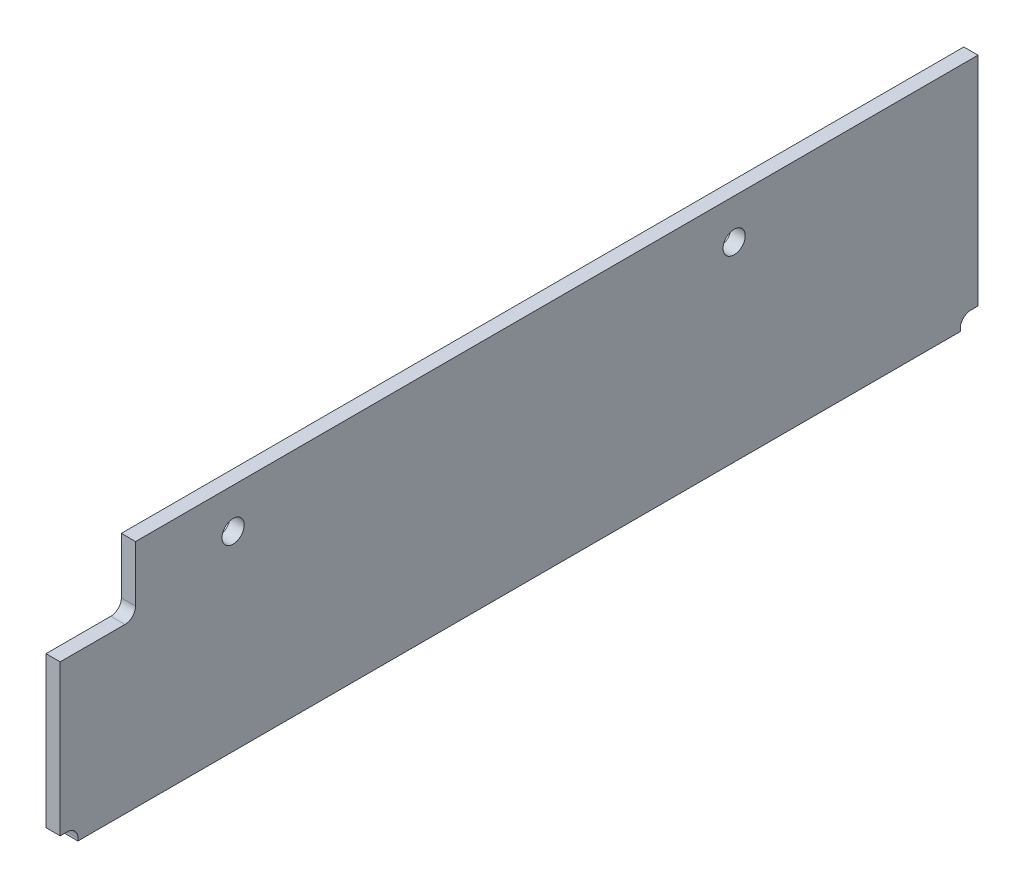
ISO-10303-21;
HEADER;
FILE_DESCRIPTION(('STEP AP214'),'2;1');
FILE_NAME('part.step','',(''),(''),'','','');
FILE_SCHEMA(('AUTOMOTIVE_DESIGN { 1 0 10303 214 1 1 1 1 }'));
ENDSEC;
DATA;
#1=APPLICATION_CONTEXT('core data for automotive mechanical design processes');
#2=APPLICATION_PROTOCOL_DEFINITION('international standard','automotive_design',2000,#1);
#3=PRODUCT_CONTEXT('',#1,'mechanical');
#4=PRODUCT('Part','Part','',(#3));
#5=PRODUCT_RELATED_PRODUCT_CATEGORY('part','',(#4));
#6=PRODUCT_DEFINITION_FORMATION('','',#4);
#7=PRODUCT_DEFINITION_CONTEXT('part definition',#1,'design');
#8=PRODUCT_DEFINITION('design','',#6,#7);
#9=PRODUCT_DEFINITION_SHAPE('','',#8);
#10=(LENGTH_UNIT() NAMED_UNIT(*) SI_UNIT(.MILLI.,.METRE.));
#11=(NAMED_UNIT(*) PLANE_ANGLE_UNIT() SI_UNIT($,.RADIAN.));
#12=(NAMED_UNIT(*) SI_UNIT($,.STERADIAN.) SOLID_ANGLE_UNIT());
#13=UNCERTAINTY_MEASURE_WITH_UNIT(LENGTH_MEASURE(1.E-05),#10,'distance_accuracy_value','');
#14=(GEOMETRIC_REPRESENTATION_CONTEXT(3) GLOBAL_UNCERTAINTY_ASSIGNED_CONTEXT((#13)) GLOBAL_UNIT_ASSIGNED_CONTEXT((#10,
#11,#12)) REPRESENTATION_CONTEXT('',''));
#15=CARTESIAN_POINT('',(0.,0.,0.));
#16=DIRECTION('',(0.,0.,1.));
#17=DIRECTION('',(1.,0.,0.));
#18=AXIS2_PLACEMENT_3D('',#15,#16,#17);
#19=CARTESIAN_POINT('',(36.31,-20.8500000000002,15.795));
#20=DIRECTION('',(-1.,0.,0.));
#21=DIRECTION('',(0.,0.,1.));
#22=AXIS2_PLACEMENT_3D('',#19,#20,#21);
#23=PLANE('',#22);
#24=CARTESIAN_POINT('',(36.31,0.349999999999792,42.495));
#25=DIRECTION('',(-1.,0.,0.));
#26=DIRECTION('',(0.,1.,0.));
#27=AXIS2_PLACEMENT_3D('',#24,#25,#26);
#28=CIRCLE('',#27,1.25);
#29=CARTESIAN_POINT('',(36.31,1.59999999999979,42.495));
#30=VERTEX_POINT('',#29);
#31=EDGE_CURVE('E130',#30,#30,#28,.T.);
#32=ORIENTED_EDGE('',*,*,#31,.F.);
#33=EDGE_LOOP('',(#32));
#34=FACE_BOUND('',#33,.T.);
#35=CARTESIAN_POINT('',(36.31,0.349999999999792,98.995));
#36=DIRECTION('',(-1.,0.,0.));
#37=DIRECTION('',(0.,1.,0.));
#38=AXIS2_PLACEMENT_3D('',#35,#36,#37);
#39=CIRCLE('',#38,1.25);
#40=CARTESIAN_POINT('',(36.31,1.59999999999979,98.995));
#41=VERTEX_POINT('',#40);
#42=EDGE_CURVE('E133',#41,#41,#39,.T.);
#43=ORIENTED_EDGE('',*,*,#42,.F.);
#44=EDGE_LOOP('',(#43));
#45=FACE_BOUND('',#44,.T.);
#46=DIRECTION('',(0.,1.,0.));
#47=VECTOR('',#46,1.);
#48=CARTESIAN_POINT('',(36.31,-20.8500000000002,14.995));
#49=LINE('',#48,#47);
#50=CARTESIAN_POINT('',(36.31,-19.6500000000002,14.995));
#51=VERTEX_POINT('',#50);
#52=CARTESIAN_POINT('',(36.31,4.84999999999979,14.995));
#53=VERTEX_POINT('',#52);
#54=EDGE_CURVE('E140',#51,#53,#49,.T.);
#55=ORIENTED_EDGE('',*,*,#54,.F.);
#56=DIRECTION('',(0.,0.,1.));
#57=VECTOR('',#56,1.);
#58=CARTESIAN_POINT('',(36.31,-19.6500000000002,14.995));
#59=LINE('',#58,#57);
#60=CARTESIAN_POINT('',(36.31,-19.6500000000002,15.795));
#61=VERTEX_POINT('',#60);
#62=EDGE_CURVE('E11',#51,#61,#59,.T.);
#63=ORIENTED_EDGE('',*,*,#62,.T.);
#64=CARTESIAN_POINT('',(36.31,-20.8500000000002,15.795));
#65=DIRECTION('',(-1.,0.,0.));
#66=DIRECTION('',(0.,1.,0.));
#67=AXIS2_PLACEMENT_3D('',#64,#65,#66);
#68=CIRCLE('',#67,1.2);
#69=CARTESIAN_POINT('',(36.31,-20.8500000000002,16.995));
#70=VERTEX_POINT('',#69);
#71=EDGE_CURVE('E141',#70,#61,#68,.T.);
#72=ORIENTED_EDGE('',*,*,#71,.F.);
#73=DIRECTION('',(0.,-1.,0.));
#74=VECTOR('',#73,1.);
#75=CARTESIAN_POINT('',(36.31,-20.8500000000002,16.995));
#76=LINE('',#75,#74);
#77=CARTESIAN_POINT('',(36.31,-21.1500000000002,16.995));
#78=VERTEX_POINT('',#77);
#79=EDGE_CURVE('E27',#70,#78,#76,.T.);
#80=ORIENTED_EDGE('',*,*,#79,.T.);
#81=DIRECTION('',(0.,0.,-1.));
#82=VECTOR('',#81,1.);
#83=CARTESIAN_POINT('',(36.31,-21.1500000000002,15.795));
#84=LINE('',#83,#82);
#85=CARTESIAN_POINT('',(36.31,-21.1500000000002,116.495));
#86=VERTEX_POINT('',#85);
#87=EDGE_CURVE('E162',#86,#78,#84,.T.);
#88=ORIENTED_EDGE('',*,*,#87,.F.);
#89=DIRECTION('',(0.,1.,0.));
#90=VECTOR('',#89,1.);
#91=CARTESIAN_POINT('',(36.31,-21.1500000000002,116.495));
#92=LINE('',#91,#90);
#93=CARTESIAN_POINT('',(36.31,-20.8500000000002,116.495));
#94=VERTEX_POINT('',#93);
#95=EDGE_CURVE('E146',#86,#94,#92,.T.);
#96=ORIENTED_EDGE('',*,*,#95,.T.);
#97=CARTESIAN_POINT('',(36.31,-20.8500000000002,117.695));
#98=DIRECTION('',(-1.,0.,0.));
#99=DIRECTION('',(0.,1.,0.));
#100=AXIS2_PLACEMENT_3D('',#97,#98,#99);
#101=CIRCLE('',#100,1.2);
#102=CARTESIAN_POINT('',(36.31,-19.6500000000002,117.695));
#103=VERTEX_POINT('',#102);
#104=EDGE_CURVE('E124',#103,#94,#101,.T.);
#105=ORIENTED_EDGE('',*,*,#104,.F.);
#106=DIRECTION('',(0.,0.,-1.));
#107=VECTOR('',#106,1.);
#108=CARTESIAN_POINT('',(36.31,-19.6500000000002,15.795));
#109=LINE('',#108,#107);
#110=CARTESIAN_POINT('',(36.31,-19.6500000000002,118.495));
#111=VERTEX_POINT('',#110);
#112=EDGE_CURVE('E166',#111,#103,#109,.T.);
#113=ORIENTED_EDGE('',*,*,#112,.F.);
#114=DIRECTION('',(0.,-1.,0.));
#115=VECTOR('',#114,1.);
#116=CARTESIAN_POINT('',(36.31,-20.8500000000002,118.495));
#117=LINE('',#116,#115);
#118=CARTESIAN_POINT('',(36.31,-2.65000000000021,118.495));
#119=VERTEX_POINT('',#118);
#120=EDGE_CURVE('E186',#119,#111,#117,.T.);
#121=ORIENTED_EDGE('',*,*,#120,.F.);
#122=DIRECTION('',(0.,0.,1.));
#123=VECTOR('',#122,1.);
#124=CARTESIAN_POINT('',(36.31,-2.65000000000021,15.795));
#125=LINE('',#124,#123);
#126=CARTESIAN_POINT('',(36.31,-2.65000000000021,111.195));
#127=VERTEX_POINT('',#126);
#128=EDGE_CURVE('E206',#127,#119,#125,.T.);
#129=ORIENTED_EDGE('',*,*,#128,.F.);
#130=CARTESIAN_POINT('',(36.31,-1.45000000000021,111.195));
#131=DIRECTION('',(-1.,0.,0.));
#132=DIRECTION('',(0.,1.,0.));
#133=AXIS2_PLACEMENT_3D('',#130,#131,#132);
#134=CIRCLE('',#133,1.20000000000001);
#135=CARTESIAN_POINT('',(36.31,-1.45000000000021,109.995));
#136=VERTEX_POINT('',#135);
#137=EDGE_CURVE('E214',#136,#127,#134,.T.);
#138=ORIENTED_EDGE('',*,*,#137,.F.);
#139=DIRECTION('',(0.,-1.,0.));
#140=VECTOR('',#139,1.);
#141=CARTESIAN_POINT('',(36.31,-20.8500000000002,109.995));
#142=LINE('',#141,#140);
#143=CARTESIAN_POINT('',(36.31,4.84999999999979,109.995));
#144=VERTEX_POINT('',#143);
#145=EDGE_CURVE('E151',#144,#136,#142,.T.);
#146=ORIENTED_EDGE('',*,*,#145,.F.);
#147=DIRECTION('',(0.,0.,1.));
#148=VECTOR('',#147,1.);
#149=CARTESIAN_POINT('',(36.31,4.84999999999979,15.795));
#150=LINE('',#149,#148);
#151=EDGE_CURVE('E148',#53,#144,#150,.T.);
#152=ORIENTED_EDGE('',*,*,#151,.F.);
#153=EDGE_LOOP('',(#55,#63,#72,#80,#88,#96,#105,#113,#121,#129,#138,#146,#152));
#154=FACE_BOUND('',#153,.T.);
#155=ADVANCED_FACE('F17',(#34,#45,#154),#23,.T.);
#156=CARTESIAN_POINT('',(36.31,4.84999999999979,109.995));
#157=DIRECTION('',(0.,1.,0.));
#158=DIRECTION('',(0.,0.,1.));
#159=AXIS2_PLACEMENT_3D('',#156,#157,#158);
#160=PLANE('',#159);
#161=DIRECTION('',(1.,0.,0.));
#162=VECTOR('',#161,1.);
#163=CARTESIAN_POINT('',(36.31,4.84999999999979,14.995));
#164=LINE('',#163,#162);
#165=CARTESIAN_POINT('',(37.91,4.84999999999979,14.995));
#166=VERTEX_POINT('',#165);
#167=EDGE_CURVE('E137',#53,#166,#164,.T.);
#168=ORIENTED_EDGE('',*,*,#167,.F.);
#169=ORIENTED_EDGE('',*,*,#151,.T.);
#170=DIRECTION('',(-1.,0.,0.));
#171=VECTOR('',#170,1.);
#172=CARTESIAN_POINT('',(36.31,4.84999999999979,109.995));
#173=LINE('',#172,#171);
#174=CARTESIAN_POINT('',(37.91,4.84999999999979,109.995));
#175=VERTEX_POINT('',#174);
#176=EDGE_CURVE('E169',#175,#144,#173,.T.);
#177=ORIENTED_EDGE('',*,*,#176,.F.);
#178=DIRECTION('',(0.,0.,1.));
#179=VECTOR('',#178,1.);
#180=CARTESIAN_POINT('',(37.91,4.84999999999979,109.995));
#181=LINE('',#180,#179);
#182=EDGE_CURVE('E177',#166,#175,#181,.T.);
#183=ORIENTED_EDGE('',*,*,#182,.F.);
#184=EDGE_LOOP('',(#168,#169,#177,#183));
#185=FACE_BOUND('',#184,.T.);
#186=ADVANCED_FACE('F255',(#185),#160,.T.);
#187=CARTESIAN_POINT('',(36.31,4.84999999999979,14.995));
#188=DIRECTION('',(0.,0.,-1.));
#189=DIRECTION('',(-1.,0.,0.));
#190=AXIS2_PLACEMENT_3D('',#187,#188,#189);
#191=PLANE('',#190);
#192=DIRECTION('',(1.,0.,0.));
#193=VECTOR('',#192,1.);
#194=CARTESIAN_POINT('',(36.31,-19.6500000000002,14.995));
#195=LINE('',#194,#193);
#196=CARTESIAN_POINT('',(37.91,-19.6500000000002,14.995));
#197=VERTEX_POINT('',#196);
#198=EDGE_CURVE('E36',#51,#197,#195,.T.);
#199=ORIENTED_EDGE('',*,*,#198,.F.);
#200=ORIENTED_EDGE('',*,*,#54,.T.);
#201=ORIENTED_EDGE('',*,*,#167,.T.);
#202=DIRECTION('',(0.,1.,0.));
#203=VECTOR('',#202,1.);
#204=CARTESIAN_POINT('',(37.91,4.84999999999979,14.995));
#205=LINE('',#204,#203);
#206=EDGE_CURVE('E157',#197,#166,#205,.T.);
#207=ORIENTED_EDGE('',*,*,#206,.F.);
#208=EDGE_LOOP('',(#199,#200,#201,#207));
#209=FACE_BOUND('',#208,.T.);
#210=ADVANCED_FACE('F261',(#209),#191,.T.);
#211=CARTESIAN_POINT('',(36.31,-20.8500000000002,15.795));
#212=DIRECTION('',(-1.,0.,0.));
#213=DIRECTION('',(0.,0.,1.));
#214=AXIS2_PLACEMENT_3D('',#211,#212,#213);
#215=CYLINDRICAL_SURFACE('',#214,1.2);
#216=DIRECTION('',(1.,0.,0.));
#217=VECTOR('',#216,1.);
#218=CARTESIAN_POINT('',(36.31,-20.8500000000002,16.995));
#219=LINE('',#218,#217);
#220=CARTESIAN_POINT('',(37.91,-20.8500000000002,16.995));
#221=VERTEX_POINT('',#220);
#222=EDGE_CURVE('E126',#70,#221,#219,.T.);
#223=ORIENTED_EDGE('',*,*,#222,.F.);
#224=ORIENTED_EDGE('',*,*,#71,.T.);
#225=DIRECTION('',(-1.,0.,0.));
#226=VECTOR('',#225,1.);
#227=CARTESIAN_POINT('',(36.31,-19.6500000000002,15.795));
#228=LINE('',#227,#226);
#229=CARTESIAN_POINT('',(37.91,-19.6500000000002,15.795));
#230=VERTEX_POINT('',#229);
#231=EDGE_CURVE('E200',#230,#61,#228,.T.);
#232=ORIENTED_EDGE('',*,*,#231,.F.);
#233=CARTESIAN_POINT('',(37.91,-20.8500000000002,15.795));
#234=DIRECTION('',(-1.,0.,0.));
#235=DIRECTION('',(0.,1.,0.));
#236=AXIS2_PLACEMENT_3D('',#233,#234,#235);
#237=CIRCLE('',#236,1.2);
#238=EDGE_CURVE('E180',#221,#230,#237,.T.);
#239=ORIENTED_EDGE('',*,*,#238,.F.);
#240=EDGE_LOOP('',(#223,#224,#232,#239));
#241=FACE_BOUND('',#240,.T.);
#242=ADVANCED_FACE('F248',(#241),#215,.F.);
#243=CARTESIAN_POINT('',(36.31,-21.1500000000002,16.995));
#244=DIRECTION('',(0.,-1.,0.));
#245=DIRECTION('',(0.,0.,-1.));
#246=AXIS2_PLACEMENT_3D('',#243,#244,#245);
#247=PLANE('',#246);
#248=DIRECTION('',(1.,0.,0.));
#249=VECTOR('',#248,1.);
#250=CARTESIAN_POINT('',(36.31,-21.1500000000002,116.495));
#251=LINE('',#250,#249);
#252=CARTESIAN_POINT('',(37.91,-21.1500000000002,116.495));
#253=VERTEX_POINT('',#252);
#254=EDGE_CURVE('E101',#86,#253,#251,.T.);
#255=ORIENTED_EDGE('',*,*,#254,.F.);
#256=ORIENTED_EDGE('',*,*,#87,.T.);
#257=DIRECTION('',(-1.,0.,0.));
#258=VECTOR('',#257,1.);
#259=CARTESIAN_POINT('',(36.31,-21.1500000000002,16.995));
#260=LINE('',#259,#258);
#261=CARTESIAN_POINT('',(37.91,-21.1500000000002,16.995));
#262=VERTEX_POINT('',#261);
#263=EDGE_CURVE('E128',#262,#78,#260,.T.);
#264=ORIENTED_EDGE('',*,*,#263,.F.);
#265=DIRECTION('',(0.,0.,-1.));
#266=VECTOR('',#265,1.);
#267=CARTESIAN_POINT('',(37.91,-21.1500000000002,16.995));
#268=LINE('',#267,#266);
#269=EDGE_CURVE('E112',#253,#262,#268,.T.);
#270=ORIENTED_EDGE('',*,*,#269,.F.);
#271=EDGE_LOOP('',(#255,#256,#264,#270));
#272=FACE_BOUND('',#271,.T.);
#273=ADVANCED_FACE('F238',(#272),#247,.T.);
#274=CARTESIAN_POINT('',(36.31,-20.8500000000002,117.695));
#275=DIRECTION('',(-1.,0.,0.));
#276=DIRECTION('',(0.,0.,1.));
#277=AXIS2_PLACEMENT_3D('',#274,#275,#276);
#278=CYLINDRICAL_SURFACE('',#277,1.2);
#279=DIRECTION('',(1.,0.,0.));
#280=VECTOR('',#279,1.);
#281=CARTESIAN_POINT('',(36.31,-19.6500000000002,117.695));
#282=LINE('',#281,#280);
#283=CARTESIAN_POINT('',(37.91,-19.6500000000002,117.695));
#284=VERTEX_POINT('',#283);
#285=EDGE_CURVE('E184',#103,#284,#282,.T.);
#286=ORIENTED_EDGE('',*,*,#285,.F.);
#287=ORIENTED_EDGE('',*,*,#104,.T.);
#288=DIRECTION('',(-1.,0.,0.));
#289=VECTOR('',#288,1.);
#290=CARTESIAN_POINT('',(36.31,-20.8500000000002,116.495));
#291=LINE('',#290,#289);
#292=CARTESIAN_POINT('',(37.91,-20.8500000000002,116.495));
#293=VERTEX_POINT('',#292);
#294=EDGE_CURVE('E21',#293,#94,#291,.T.);
#295=ORIENTED_EDGE('',*,*,#294,.F.);
#296=CARTESIAN_POINT('',(37.91,-20.8500000000002,117.695));
#297=DIRECTION('',(-1.,0.,0.));
#298=DIRECTION('',(0.,1.,0.));
#299=AXIS2_PLACEMENT_3D('',#296,#297,#298);
#300=CIRCLE('',#299,1.2);
#301=EDGE_CURVE('E111',#284,#293,#300,.T.);
#302=ORIENTED_EDGE('',*,*,#301,.F.);
#303=EDGE_LOOP('',(#286,#287,#295,#302));
#304=FACE_BOUND('',#303,.T.);
#305=ADVANCED_FACE('F122',(#304),#278,.F.);
#306=CARTESIAN_POINT('',(36.31,-19.6500000000002,117.695));
#307=DIRECTION('',(0.,-1.,0.));
#308=DIRECTION('',(0.,0.,-1.));
#309=AXIS2_PLACEMENT_3D('',#306,#307,#308);
#310=PLANE('',#309);
#311=DIRECTION('',(1.,0.,0.));
#312=VECTOR('',#311,1.);
#313=CARTESIAN_POINT('',(36.31,-19.6500000000002,118.495));
#314=LINE('',#313,#312);
#315=CARTESIAN_POINT('',(37.91,-19.6500000000002,118.495));
#316=VERTEX_POINT('',#315);
#317=EDGE_CURVE('E208',#111,#316,#314,.T.);
#318=ORIENTED_EDGE('',*,*,#317,.F.);
#319=ORIENTED_EDGE('',*,*,#112,.T.);
#320=ORIENTED_EDGE('',*,*,#285,.T.);
#321=DIRECTION('',(0.,0.,-1.));
#322=VECTOR('',#321,1.);
#323=CARTESIAN_POINT('',(37.91,-19.6500000000002,117.695));
#324=LINE('',#323,#322);
#325=EDGE_CURVE('E118',#316,#284,#324,.T.);
#326=ORIENTED_EDGE('',*,*,#325,.F.);
#327=EDGE_LOOP('',(#318,#319,#320,#326));
#328=FACE_BOUND('',#327,.T.);
#329=ADVANCED_FACE('F232',(#328),#310,.T.);
#330=CARTESIAN_POINT('',(36.31,-19.6500000000002,118.495));
#331=DIRECTION('',(0.,0.,1.));
#332=DIRECTION('',(1.,0.,0.));
#333=AXIS2_PLACEMENT_3D('',#330,#331,#332);
#334=PLANE('',#333);
#335=DIRECTION('',(1.,0.,0.));
#336=VECTOR('',#335,1.);
#337=CARTESIAN_POINT('',(36.31,-2.65000000000021,118.495));
#338=LINE('',#337,#336);
#339=CARTESIAN_POINT('',(37.91,-2.65000000000021,118.495));
#340=VERTEX_POINT('',#339);
#341=EDGE_CURVE('E209',#119,#340,#338,.T.);
#342=ORIENTED_EDGE('',*,*,#341,.F.);
#343=ORIENTED_EDGE('',*,*,#120,.T.);
#344=ORIENTED_EDGE('',*,*,#317,.T.);
#345=DIRECTION('',(0.,-1.,0.));
#346=VECTOR('',#345,1.);
#347=CARTESIAN_POINT('',(37.91,-19.6500000000002,118.495));
#348=LINE('',#347,#346);
#349=EDGE_CURVE('E183',#340,#316,#348,.T.);
#350=ORIENTED_EDGE('',*,*,#349,.F.);
#351=EDGE_LOOP('',(#342,#343,#344,#350));
#352=FACE_BOUND('',#351,.T.);
#353=ADVANCED_FACE('F228',(#352),#334,.T.);
#354=CARTESIAN_POINT('',(36.31,-2.65000000000021,118.495));
#355=DIRECTION('',(0.,1.,0.));
#356=DIRECTION('',(0.,0.,1.));
#357=AXIS2_PLACEMENT_3D('',#354,#355,#356);
#358=PLANE('',#357);
#359=DIRECTION('',(1.,0.,0.));
#360=VECTOR('',#359,1.);
#361=CARTESIAN_POINT('',(36.31,-2.65000000000021,111.195));
#362=LINE('',#361,#360);
#363=CARTESIAN_POINT('',(37.91,-2.65000000000021,111.195));
#364=VERTEX_POINT('',#363);
#365=EDGE_CURVE('E172',#127,#364,#362,.T.);
#366=ORIENTED_EDGE('',*,*,#365,.F.);
#367=ORIENTED_EDGE('',*,*,#128,.T.);
#368=ORIENTED_EDGE('',*,*,#341,.T.);
#369=DIRECTION('',(0.,0.,1.));
#370=VECTOR('',#369,1.);
#371=CARTESIAN_POINT('',(37.91,-2.65000000000021,118.495));
#372=LINE('',#371,#370);
#373=EDGE_CURVE('E145',#364,#340,#372,.T.);
#374=ORIENTED_EDGE('',*,*,#373,.F.);
#375=EDGE_LOOP('',(#366,#367,#368,#374));
#376=FACE_BOUND('',#375,.T.);
#377=ADVANCED_FACE('F291',(#376),#358,.T.);
#378=CARTESIAN_POINT('',(36.31,-1.45000000000021,111.195));
#379=DIRECTION('',(-1.,0.,0.));
#380=DIRECTION('',(0.,0.,1.));
#381=AXIS2_PLACEMENT_3D('',#378,#379,#380);
#382=CYLINDRICAL_SURFACE('',#381,1.20000000000001);
#383=DIRECTION('',(1.,0.,0.));
#384=VECTOR('',#383,1.);
#385=CARTESIAN_POINT('',(36.31,-1.45000000000021,109.995));
#386=LINE('',#385,#384);
#387=CARTESIAN_POINT('',(37.91,-1.45000000000021,109.995));
#388=VERTEX_POINT('',#387);
#389=EDGE_CURVE('E149',#136,#388,#386,.T.);
#390=ORIENTED_EDGE('',*,*,#389,.F.);
#391=ORIENTED_EDGE('',*,*,#137,.T.);
#392=ORIENTED_EDGE('',*,*,#365,.T.);
#393=CARTESIAN_POINT('',(37.91,-1.45000000000021,111.195));
#394=DIRECTION('',(-1.,0.,0.));
#395=DIRECTION('',(0.,1.,0.));
#396=AXIS2_PLACEMENT_3D('',#393,#394,#395);
#397=CIRCLE('',#396,1.20000000000001);
#398=EDGE_CURVE('E142',#388,#364,#397,.T.);
#399=ORIENTED_EDGE('',*,*,#398,.F.);
#400=EDGE_LOOP('',(#390,#391,#392,#399));
#401=FACE_BOUND('',#400,.T.);
#402=ADVANCED_FACE('F294',(#401),#382,.F.);
#403=CARTESIAN_POINT('',(36.31,-1.45000000000021,109.995));
#404=DIRECTION('',(0.,0.,1.));
#405=DIRECTION('',(1.,0.,0.));
#406=AXIS2_PLACEMENT_3D('',#403,#404,#405);
#407=PLANE('',#406);
#408=ORIENTED_EDGE('',*,*,#176,.T.);
#409=ORIENTED_EDGE('',*,*,#145,.T.);
#410=ORIENTED_EDGE('',*,*,#389,.T.);
#411=DIRECTION('',(0.,-1.,0.));
#412=VECTOR('',#411,1.);
#413=CARTESIAN_POINT('',(37.91,-1.45000000000021,109.995));
#414=LINE('',#413,#412);
#415=EDGE_CURVE('E144',#175,#388,#414,.T.);
#416=ORIENTED_EDGE('',*,*,#415,.F.);
#417=EDGE_LOOP('',(#408,#409,#410,#416));
#418=FACE_BOUND('',#417,.T.);
#419=ADVANCED_FACE('F258',(#418),#407,.T.);
#420=CARTESIAN_POINT('',(37.91,-20.8500000000002,15.795));
#421=DIRECTION('',(1.,0.,0.));
#422=DIRECTION('',(0.,0.,-1.));
#423=AXIS2_PLACEMENT_3D('',#420,#421,#422);
#424=PLANE('',#423);
#425=CARTESIAN_POINT('',(37.91,0.349999999999792,42.495));
#426=DIRECTION('',(-1.,0.,0.));
#427=DIRECTION('',(0.,1.,0.));
#428=AXIS2_PLACEMENT_3D('',#425,#426,#427);
#429=CIRCLE('',#428,1.25);
#430=CARTESIAN_POINT('',(37.91,1.59999999999979,42.495));
#431=VERTEX_POINT('',#430);
#432=EDGE_CURVE('E152',#431,#431,#429,.T.);
#433=ORIENTED_EDGE('',*,*,#432,.T.);
#434=EDGE_LOOP('',(#433));
#435=FACE_BOUND('',#434,.T.);
#436=CARTESIAN_POINT('',(37.91,0.349999999999792,98.995));
#437=DIRECTION('',(-1.,0.,0.));
#438=DIRECTION('',(0.,1.,0.));
#439=AXIS2_PLACEMENT_3D('',#436,#437,#438);
#440=CIRCLE('',#439,1.25);
#441=CARTESIAN_POINT('',(37.91,1.59999999999979,98.995));
#442=VERTEX_POINT('',#441);
#443=EDGE_CURVE('E156',#442,#442,#440,.T.);
#444=ORIENTED_EDGE('',*,*,#443,.T.);
#445=EDGE_LOOP('',(#444));
#446=FACE_BOUND('',#445,.T.);
#447=DIRECTION('',(0.,0.,-1.));
#448=VECTOR('',#447,1.);
#449=CARTESIAN_POINT('',(37.91,-19.6500000000002,15.795));
#450=LINE('',#449,#448);
#451=EDGE_CURVE('E154',#230,#197,#450,.T.);
#452=ORIENTED_EDGE('',*,*,#451,.T.);
#453=ORIENTED_EDGE('',*,*,#206,.T.);
#454=ORIENTED_EDGE('',*,*,#182,.T.);
#455=ORIENTED_EDGE('',*,*,#415,.T.);
#456=ORIENTED_EDGE('',*,*,#398,.T.);
#457=ORIENTED_EDGE('',*,*,#373,.T.);
#458=ORIENTED_EDGE('',*,*,#349,.T.);
#459=ORIENTED_EDGE('',*,*,#325,.T.);
#460=ORIENTED_EDGE('',*,*,#301,.T.);
#461=DIRECTION('',(0.,-1.,0.));
#462=VECTOR('',#461,1.);
#463=CARTESIAN_POINT('',(37.91,-20.8500000000002,116.495));
#464=LINE('',#463,#462);
#465=EDGE_CURVE('E104',#293,#253,#464,.T.);
#466=ORIENTED_EDGE('',*,*,#465,.T.);
#467=ORIENTED_EDGE('',*,*,#269,.T.);
#468=DIRECTION('',(0.,1.,0.));
#469=VECTOR('',#468,1.);
#470=CARTESIAN_POINT('',(37.91,-20.8500000000002,16.995));
#471=LINE('',#470,#469);
#472=EDGE_CURVE('E174',#262,#221,#471,.T.);
#473=ORIENTED_EDGE('',*,*,#472,.T.);
#474=ORIENTED_EDGE('',*,*,#238,.T.);
#475=EDGE_LOOP('',(#452,#453,#454,#455,#456,#457,#458,#459,#460,#466,#467,#473,#474));
#476=FACE_BOUND('',#475,.T.);
#477=ADVANCED_FACE('F116',(#435,#446,#476),#424,.T.);
#478=CARTESIAN_POINT('',(36.31,-19.6500000000002,14.995));
#479=DIRECTION('',(0.,-1.,0.));
#480=DIRECTION('',(0.,0.,-1.));
#481=AXIS2_PLACEMENT_3D('',#478,#479,#480);
#482=PLANE('',#481);
#483=ORIENTED_EDGE('',*,*,#231,.T.);
#484=ORIENTED_EDGE('',*,*,#62,.F.);
#485=ORIENTED_EDGE('',*,*,#198,.T.);
#486=ORIENTED_EDGE('',*,*,#451,.F.);
#487=EDGE_LOOP('',(#483,#484,#485,#486));
#488=FACE_BOUND('',#487,.T.);
#489=ADVANCED_FACE('F262',(#488),#482,.T.);
#490=CARTESIAN_POINT('',(36.31,-20.8500000000002,16.995));
#491=DIRECTION('',(0.,0.,-1.));
#492=DIRECTION('',(-1.,0.,0.));
#493=AXIS2_PLACEMENT_3D('',#490,#491,#492);
#494=PLANE('',#493);
#495=ORIENTED_EDGE('',*,*,#263,.T.);
#496=ORIENTED_EDGE('',*,*,#79,.F.);
#497=ORIENTED_EDGE('',*,*,#222,.T.);
#498=ORIENTED_EDGE('',*,*,#472,.F.);
#499=EDGE_LOOP('',(#495,#496,#497,#498));
#500=FACE_BOUND('',#499,.T.);
#501=ADVANCED_FACE('F245',(#500),#494,.T.);
#502=CARTESIAN_POINT('',(36.31,-21.1500000000002,116.495));
#503=DIRECTION('',(0.,0.,1.));
#504=DIRECTION('',(1.,0.,0.));
#505=AXIS2_PLACEMENT_3D('',#502,#503,#504);
#506=PLANE('',#505);
#507=ORIENTED_EDGE('',*,*,#294,.T.);
#508=ORIENTED_EDGE('',*,*,#95,.F.);
#509=ORIENTED_EDGE('',*,*,#254,.T.);
#510=ORIENTED_EDGE('',*,*,#465,.F.);
#511=EDGE_LOOP('',(#507,#508,#509,#510));
#512=FACE_BOUND('',#511,.T.);
#513=ADVANCED_FACE('F106',(#512),#506,.T.);
#514=CARTESIAN_POINT('',(36.31,0.349999999999792,42.495));
#515=DIRECTION('',(-1.,0.,0.));
#516=DIRECTION('',(0.,0.,1.));
#517=AXIS2_PLACEMENT_3D('',#514,#515,#516);
#518=CYLINDRICAL_SURFACE('',#517,1.25);
#519=ORIENTED_EDGE('',*,*,#432,.F.);
#520=EDGE_LOOP('',(#519));
#521=FACE_BOUND('',#520,.T.);
#522=ORIENTED_EDGE('',*,*,#31,.T.);
#523=EDGE_LOOP('',(#522));
#524=FACE_BOUND('',#523,.T.);
#525=ADVANCED_FACE('F305',(#521,#524),#518,.F.);
#526=CARTESIAN_POINT('',(36.31,0.349999999999792,98.995));
#527=DIRECTION('',(-1.,0.,0.));
#528=DIRECTION('',(0.,0.,1.));
#529=AXIS2_PLACEMENT_3D('',#526,#527,#528);
#530=CYLINDRICAL_SURFACE('',#529,1.25);
#531=ORIENTED_EDGE('',*,*,#443,.F.);
#532=EDGE_LOOP('',(#531));
#533=FACE_BOUND('',#532,.T.);
#534=ORIENTED_EDGE('',*,*,#42,.T.);
#535=EDGE_LOOP('',(#534));
#536=FACE_BOUND('',#535,.T.);
#537=ADVANCED_FACE('F19',(#533,#536),#530,.F.);
#538=CLOSED_SHELL('',(#155,#186,#210,#242,#273,#305,#329,#353,#377,#402,#419,#477,#489,#501,
#513,#525,#537));
#539=MANIFOLD_SOLID_BREP('B1',#538);
#540=ADVANCED_BREP_SHAPE_REPRESENTATION('',(#18,#539),#14);
#541=SHAPE_DEFINITION_REPRESENTATION(#9,#540);
ENDSEC;
END-ISO-10303-21;
